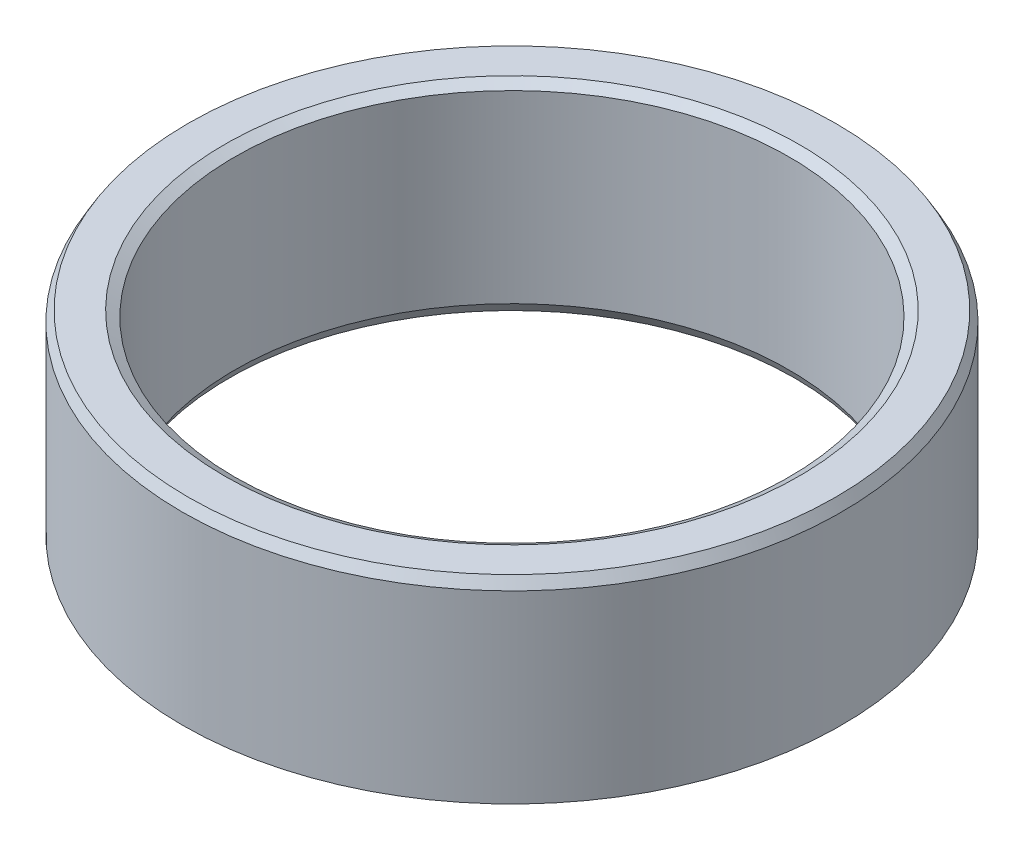
ISO-10303-21;
HEADER;
FILE_DESCRIPTION(('STEP AP214'),'2;1');
FILE_NAME('part.step','',(''),(''),'','','');
FILE_SCHEMA(('AUTOMOTIVE_DESIGN { 1 0 10303 214 1 1 1 1 }'));
ENDSEC;
DATA;
#1=APPLICATION_CONTEXT('core data for automotive mechanical design processes');
#2=APPLICATION_PROTOCOL_DEFINITION('international standard','automotive_design',2000,#1);
#3=PRODUCT_CONTEXT('',#1,'mechanical');
#4=PRODUCT('Part','Part','',(#3));
#5=PRODUCT_RELATED_PRODUCT_CATEGORY('part','',(#4));
#6=PRODUCT_DEFINITION_FORMATION('','',#4);
#7=PRODUCT_DEFINITION_CONTEXT('part definition',#1,'design');
#8=PRODUCT_DEFINITION('design','',#6,#7);
#9=PRODUCT_DEFINITION_SHAPE('','',#8);
#10=(LENGTH_UNIT() NAMED_UNIT(*) SI_UNIT(.MILLI.,.METRE.));
#11=(NAMED_UNIT(*) PLANE_ANGLE_UNIT() SI_UNIT($,.RADIAN.));
#12=(NAMED_UNIT(*) SI_UNIT($,.STERADIAN.) SOLID_ANGLE_UNIT());
#13=UNCERTAINTY_MEASURE_WITH_UNIT(LENGTH_MEASURE(1.E-05),#10,'distance_accuracy_value','');
#14=(GEOMETRIC_REPRESENTATION_CONTEXT(3) GLOBAL_UNCERTAINTY_ASSIGNED_CONTEXT((#13)) GLOBAL_UNIT_ASSIGNED_CONTEXT((#10,
#11,#12)) REPRESENTATION_CONTEXT('',''));
#15=CARTESIAN_POINT('',(0.,0.,0.));
#16=DIRECTION('',(0.,0.,1.));
#17=DIRECTION('',(1.,0.,0.));
#18=AXIS2_PLACEMENT_3D('',#15,#16,#17);
#19=CARTESIAN_POINT('',(0.,19.7615112975459,0.));
#20=DIRECTION('',(0.,-1.,0.));
#21=DIRECTION('',(0.,0.,-1.));
#22=AXIS2_PLACEMENT_3D('',#19,#20,#21);
#23=CYLINDRICAL_SURFACE('',#22,32.5);
#24=CARTESIAN_POINT('',(0.,0.572108986350146,0.));
#25=DIRECTION('',(0.,1.,0.));
#26=DIRECTION('',(0.,0.,1.));
#27=AXIS2_PLACEMENT_3D('',#24,#25,#26);
#28=CIRCLE('',#27,32.5);
#29=CARTESIAN_POINT('',(0.,0.572108986350146,32.5));
#30=VERTEX_POINT('',#29);
#31=EDGE_CURVE('E10',#30,#30,#28,.T.);
#32=ORIENTED_EDGE('',*,*,#31,.T.);
#33=EDGE_LOOP('',(#32));
#34=FACE_BOUND('',#33,.T.);
#35=CARTESIAN_POINT('',(0.,18.7705894657206,0.));
#36=DIRECTION('',(0.,1.,0.));
#37=DIRECTION('',(0.,0.,1.));
#38=AXIS2_PLACEMENT_3D('',#35,#36,#37);
#39=CIRCLE('',#38,32.5);
#40=CARTESIAN_POINT('',(0.,18.7705894657206,32.5));
#41=VERTEX_POINT('',#40);
#42=EDGE_CURVE('E50',#41,#41,#39,.F.);
#43=ORIENTED_EDGE('',*,*,#42,.T.);
#44=EDGE_LOOP('',(#43));
#45=FACE_BOUND('',#44,.T.);
#46=ADVANCED_FACE('F39',(#34,#45),#23,.T.);
#47=CARTESIAN_POINT('',(0.,19.7615112975459,0.));
#48=DIRECTION('',(0.,1.,0.));
#49=DIRECTION('',(0.,0.,1.));
#50=AXIS2_PLACEMENT_3D('',#47,#48,#49);
#51=PLANE('',#50);
#52=CARTESIAN_POINT('',(0.,19.7615112975459,0.));
#53=DIRECTION('',(0.,1.,0.));
#54=DIRECTION('',(0.,0.,1.));
#55=AXIS2_PLACEMENT_3D('',#52,#53,#54);
#56=CIRCLE('',#55,28.3330831981055);
#57=CARTESIAN_POINT('',(0.,19.7615112975459,28.3330831981055));
#58=VERTEX_POINT('',#57);
#59=EDGE_CURVE('E58',#58,#58,#56,.F.);
#60=ORIENTED_EDGE('',*,*,#59,.T.);
#61=EDGE_LOOP('',(#60));
#62=FACE_BOUND('',#61,.T.);
#63=CARTESIAN_POINT('',(0.,19.7615112975459,0.));
#64=DIRECTION('',(0.,1.,0.));
#65=DIRECTION('',(0.,0.,1.));
#66=AXIS2_PLACEMENT_3D('',#63,#64,#65);
#67=CIRCLE('',#66,31.9278910136498);
#68=CARTESIAN_POINT('',(0.,19.7615112975459,31.9278910136498));
#69=VERTEX_POINT('',#68);
#70=EDGE_CURVE('E61',#69,#69,#67,.T.);
#71=ORIENTED_EDGE('',*,*,#70,.T.);
#72=EDGE_LOOP('',(#71));
#73=FACE_BOUND('',#72,.T.);
#74=ADVANCED_FACE('F88',(#62,#73),#51,.T.);
#75=CARTESIAN_POINT('',(0.,0.,0.));
#76=DIRECTION('',(0.,1.,0.));
#77=DIRECTION('',(0.,0.,1.));
#78=AXIS2_PLACEMENT_3D('',#75,#76,#77);
#79=PLANE('',#78);
#80=CARTESIAN_POINT('',(0.,0.,0.));
#81=DIRECTION('',(0.,1.,0.));
#82=DIRECTION('',(0.,0.,1.));
#83=AXIS2_PLACEMENT_3D('',#80,#81,#82);
#84=CIRCLE('',#83,27.9142703526305);
#85=CARTESIAN_POINT('',(0.,0.,27.9142703526305));
#86=VERTEX_POINT('',#85);
#87=EDGE_CURVE('E51',#86,#86,#84,.T.);
#88=ORIENTED_EDGE('',*,*,#87,.T.);
#89=EDGE_LOOP('',(#88));
#90=FACE_BOUND('',#89,.T.);
#91=CARTESIAN_POINT('',(0.,0.,0.));
#92=DIRECTION('',(0.,1.,0.));
#93=DIRECTION('',(0.,0.,1.));
#94=AXIS2_PLACEMENT_3D('',#91,#92,#93);
#95=CIRCLE('',#94,31.5090781681748);
#96=CARTESIAN_POINT('',(0.,0.,31.5090781681748));
#97=VERTEX_POINT('',#96);
#98=EDGE_CURVE('E54',#97,#97,#95,.F.);
#99=ORIENTED_EDGE('',*,*,#98,.T.);
#100=EDGE_LOOP('',(#99));
#101=FACE_BOUND('',#100,.T.);
#102=ADVANCED_FACE('F83',(#90,#101),#79,.F.);
#103=CARTESIAN_POINT('',(0.,19.7615112975459,0.));
#104=DIRECTION('',(0.,-1.,0.));
#105=DIRECTION('',(0.,0.,-1.));
#106=AXIS2_PLACEMENT_3D('',#103,#104,#105);
#107=CYLINDRICAL_SURFACE('',#106,27.3421613662803);
#108=CARTESIAN_POINT('',(0.,19.1894023111957,0.));
#109=DIRECTION('',(0.,1.,0.));
#110=DIRECTION('',(0.,0.,1.));
#111=AXIS2_PLACEMENT_3D('',#108,#109,#110);
#112=CIRCLE('',#111,27.3421613662803);
#113=CARTESIAN_POINT('',(0.,19.1894023111957,27.3421613662803));
#114=VERTEX_POINT('',#113);
#115=EDGE_CURVE('E67',#114,#114,#112,.T.);
#116=ORIENTED_EDGE('',*,*,#115,.T.);
#117=EDGE_LOOP('',(#116));
#118=FACE_BOUND('',#117,.T.);
#119=CARTESIAN_POINT('',(0.,0.990921831825246,0.));
#120=DIRECTION('',(0.,1.,0.));
#121=DIRECTION('',(0.,0.,1.));
#122=AXIS2_PLACEMENT_3D('',#119,#120,#121);
#123=CIRCLE('',#122,27.3421613662803);
#124=CARTESIAN_POINT('',(0.,0.990921831825246,27.3421613662803));
#125=VERTEX_POINT('',#124);
#126=EDGE_CURVE('E69',#125,#125,#123,.F.);
#127=ORIENTED_EDGE('',*,*,#126,.T.);
#128=EDGE_LOOP('',(#127));
#129=FACE_BOUND('',#128,.T.);
#130=ADVANCED_FACE('F71',(#118,#129),#107,.F.);
#131=CARTESIAN_POINT('',(0.,19.1894023111957,0.));
#132=DIRECTION('',(0.,1.,0.));
#133=DIRECTION('',(0.,0.,1.));
#134=AXIS2_PLACEMENT_3D('',#131,#132,#133);
#135=CONICAL_SURFACE('',#134,27.3421613662803,1.0471975511966);
#136=ORIENTED_EDGE('',*,*,#59,.F.);
#137=EDGE_LOOP('',(#136));
#138=FACE_BOUND('',#137,.T.);
#139=ORIENTED_EDGE('',*,*,#115,.F.);
#140=EDGE_LOOP('',(#139));
#141=FACE_BOUND('',#140,.T.);
#142=ADVANCED_FACE('F77',(#138,#141),#135,.F.);
#143=CARTESIAN_POINT('',(0.,0.,0.));
#144=DIRECTION('',(0.,-1.,0.));
#145=DIRECTION('',(0.,0.,-1.));
#146=AXIS2_PLACEMENT_3D('',#143,#144,#145);
#147=CONICAL_SURFACE('',#146,27.9142703526305,0.523598775598292);
#148=ORIENTED_EDGE('',*,*,#126,.F.);
#149=EDGE_LOOP('',(#148));
#150=FACE_BOUND('',#149,.T.);
#151=ORIENTED_EDGE('',*,*,#87,.F.);
#152=EDGE_LOOP('',(#151));
#153=FACE_BOUND('',#152,.T.);
#154=ADVANCED_FACE('F73',(#150,#153),#147,.F.);
#155=CARTESIAN_POINT('',(0.,0.572108986350146,0.));
#156=DIRECTION('',(0.,1.,0.));
#157=DIRECTION('',(0.,0.,1.));
#158=AXIS2_PLACEMENT_3D('',#155,#156,#157);
#159=CONICAL_SURFACE('',#158,32.5,1.0471975511966);
#160=ORIENTED_EDGE('',*,*,#98,.F.);
#161=EDGE_LOOP('',(#160));
#162=FACE_BOUND('',#161,.T.);
#163=ORIENTED_EDGE('',*,*,#31,.F.);
#164=EDGE_LOOP('',(#163));
#165=FACE_BOUND('',#164,.T.);
#166=ADVANCED_FACE('F76',(#162,#165),#159,.T.);
#167=CARTESIAN_POINT('',(0.,19.7615112975459,0.));
#168=DIRECTION('',(0.,-1.,0.));
#169=DIRECTION('',(0.,0.,-1.));
#170=AXIS2_PLACEMENT_3D('',#167,#168,#169);
#171=CONICAL_SURFACE('',#170,31.9278910136498,0.523598775598298);
#172=ORIENTED_EDGE('',*,*,#42,.F.);
#173=EDGE_LOOP('',(#172));
#174=FACE_BOUND('',#173,.T.);
#175=ORIENTED_EDGE('',*,*,#70,.F.);
#176=EDGE_LOOP('',(#175));
#177=FACE_BOUND('',#176,.T.);
#178=ADVANCED_FACE('F45',(#174,#177),#171,.T.);
#179=CLOSED_SHELL('',(#46,#74,#102,#130,#142,#154,#166,#178));
#180=MANIFOLD_SOLID_BREP('B2',#179);
#181=ADVANCED_BREP_SHAPE_REPRESENTATION('',(#18,#180),#14);
#182=SHAPE_DEFINITION_REPRESENTATION(#9,#181);
ENDSEC;
END-ISO-10303-21;
